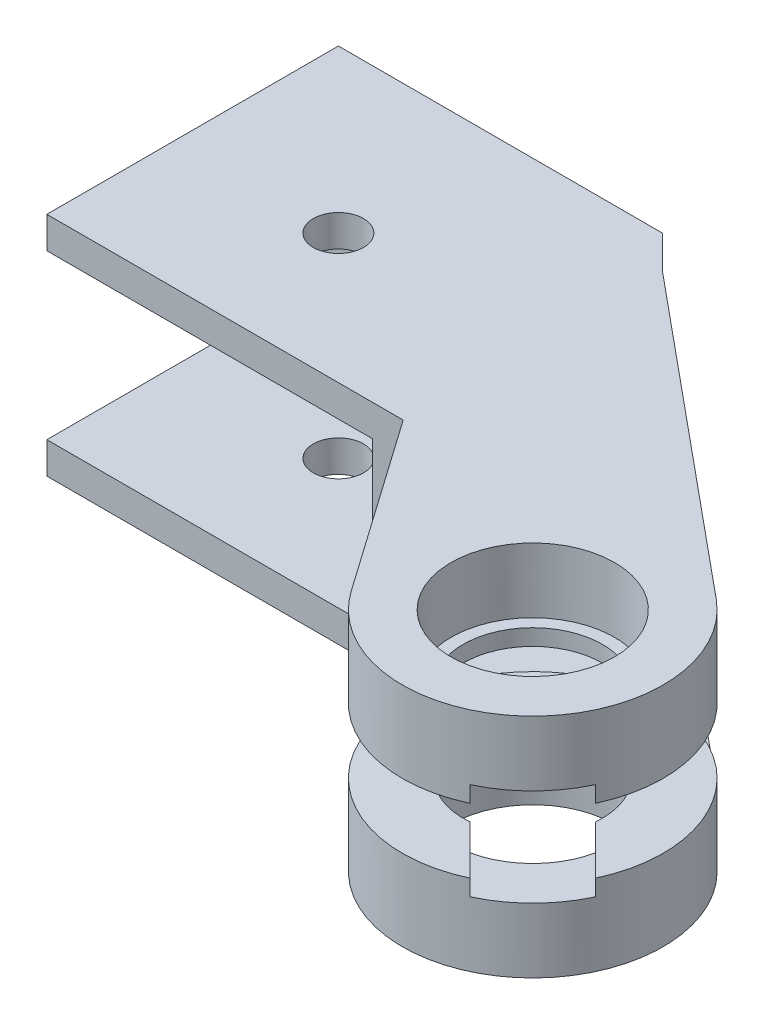
ISO-10303-21;
HEADER;
FILE_DESCRIPTION(('STEP AP214'),'2;1');
FILE_NAME('part.step','',(''),(''),'','','');
FILE_SCHEMA(('AUTOMOTIVE_DESIGN { 1 0 10303 214 1 1 1 1 }'));
ENDSEC;
DATA;
#1=APPLICATION_CONTEXT('core data for automotive mechanical design processes');
#2=APPLICATION_PROTOCOL_DEFINITION('international standard','automotive_design',2000,#1);
#3=PRODUCT_CONTEXT('',#1,'mechanical');
#4=PRODUCT('Part','Part','',(#3));
#5=PRODUCT_RELATED_PRODUCT_CATEGORY('part','',(#4));
#6=PRODUCT_DEFINITION_FORMATION('','',#4);
#7=PRODUCT_DEFINITION_CONTEXT('part definition',#1,'design');
#8=PRODUCT_DEFINITION('design','',#6,#7);
#9=PRODUCT_DEFINITION_SHAPE('','',#8);
#10=(LENGTH_UNIT() NAMED_UNIT(*) SI_UNIT(.MILLI.,.METRE.));
#11=(NAMED_UNIT(*) PLANE_ANGLE_UNIT() SI_UNIT($,.RADIAN.));
#12=(NAMED_UNIT(*) SI_UNIT($,.STERADIAN.) SOLID_ANGLE_UNIT());
#13=UNCERTAINTY_MEASURE_WITH_UNIT(LENGTH_MEASURE(1.E-05),#10,'distance_accuracy_value','');
#14=(GEOMETRIC_REPRESENTATION_CONTEXT(3) GLOBAL_UNCERTAINTY_ASSIGNED_CONTEXT((#13)) GLOBAL_UNIT_ASSIGNED_CONTEXT((#10,
#11,#12)) REPRESENTATION_CONTEXT('',''));
#15=CARTESIAN_POINT('',(0.,0.,0.));
#16=DIRECTION('',(0.,0.,1.));
#17=DIRECTION('',(1.,0.,0.));
#18=AXIS2_PLACEMENT_3D('',#15,#16,#17);
#19=CARTESIAN_POINT('',(14.1421356237309,-3.,14.142135623731));
#20=DIRECTION('',(0.,-1.,0.));
#21=DIRECTION('',(0.,0.,-1.));
#22=AXIS2_PLACEMENT_3D('',#19,#20,#21);
#23=PLANE('',#22);
#24=DIRECTION('',(-0.930502035697124,0.,0.366286720430196));
#25=VECTOR('',#24,1.);
#26=CARTESIAN_POINT('',(0.,-3.,8.));
#27=LINE('',#26,#25);
#28=CARTESIAN_POINT('',(13.1076082229817,-3.,2.84026617407359));
#29=VERTEX_POINT('',#28);
#30=CARTESIAN_POINT('',(0.,-3.,8.));
#31=VERTEX_POINT('',#30);
#32=EDGE_CURVE('E269',#29,#31,#27,.T.);
#33=ORIENTED_EDGE('',*,*,#32,.T.);
#34=DIRECTION('',(-0.574297450094056,0.,-0.81864671184551));
#35=VECTOR('',#34,1.);
#36=CARTESIAN_POINT('',(0.,-3.,8.));
#37=LINE('',#36,#35);
#38=CARTESIAN_POINT('',(7.55202959337457,-3.,18.7652300969881));
#39=VERTEX_POINT('',#38);
#40=EDGE_CURVE('E381',#39,#31,#37,.T.);
#41=ORIENTED_EDGE('',*,*,#40,.F.);
#42=CARTESIAN_POINT('',(14.1421356237309,-3.,14.142135623731));
#43=DIRECTION('',(0.,1.,0.));
#44=DIRECTION('',(0.,0.,-1.));
#45=AXIS2_PLACEMENT_3D('',#42,#43,#44);
#46=CIRCLE('',#45,8.05);
#47=CARTESIAN_POINT('',(19.2724741705051,-3.,7.93873926403554));
#48=VERTEX_POINT('',#47);
#49=EDGE_CURVE('E324',#48,#39,#46,.T.);
#50=ORIENTED_EDGE('',*,*,#49,.F.);
#51=DIRECTION('',(0.770608243440427,0.,0.637309136245244));
#52=VECTOR('',#51,1.);
#53=CARTESIAN_POINT('',(0.,-3.,-8.));
#54=LINE('',#53,#52);
#55=EDGE_CURVE('E375',#29,#48,#54,.T.);
#56=ORIENTED_EDGE('',*,*,#55,.F.);
#57=EDGE_LOOP('',(#33,#41,#50,#56));
#58=FACE_BOUND('',#57,.T.);
#59=ADVANCED_FACE('F40',(#58),#23,.F.);
#60=CARTESIAN_POINT('',(14.1421356237309,3.,14.142135623731));
#61=DIRECTION('',(0.,1.,0.));
#62=DIRECTION('',(0.,0.,-1.));
#63=AXIS2_PLACEMENT_3D('',#60,#61,#62);
#64=PLANE('',#63);
#65=DIRECTION('',(-0.930502035697124,0.,0.366286720430196));
#66=VECTOR('',#65,1.);
#67=CARTESIAN_POINT('',(0.,3.,8.));
#68=LINE('',#67,#66);
#69=CARTESIAN_POINT('',(13.1076082229817,3.,2.84026617407359));
#70=VERTEX_POINT('',#69);
#71=CARTESIAN_POINT('',(0.,3.,8.));
#72=VERTEX_POINT('',#71);
#73=EDGE_CURVE('E266',#70,#72,#68,.T.);
#74=ORIENTED_EDGE('',*,*,#73,.F.);
#75=DIRECTION('',(0.770608243440427,0.,0.637309136245244));
#76=VECTOR('',#75,1.);
#77=CARTESIAN_POINT('',(0.,3.,-8.));
#78=LINE('',#77,#76);
#79=CARTESIAN_POINT('',(19.2724741705051,3.,7.93873926403554));
#80=VERTEX_POINT('',#79);
#81=EDGE_CURVE('E355',#70,#80,#78,.T.);
#82=ORIENTED_EDGE('',*,*,#81,.T.);
#83=CARTESIAN_POINT('',(14.1421356237309,3.,14.142135623731));
#84=DIRECTION('',(0.,1.,0.));
#85=DIRECTION('',(0.,0.,-1.));
#86=AXIS2_PLACEMENT_3D('',#83,#84,#85);
#87=CIRCLE('',#86,8.05);
#88=CARTESIAN_POINT('',(7.55202959337457,3.,18.7652300969881));
#89=VERTEX_POINT('',#88);
#90=EDGE_CURVE('E294',#80,#89,#87,.T.);
#91=ORIENTED_EDGE('',*,*,#90,.T.);
#92=DIRECTION('',(-0.574297450094056,0.,-0.81864671184551));
#93=VECTOR('',#92,1.);
#94=CARTESIAN_POINT('',(0.,3.,8.));
#95=LINE('',#94,#93);
#96=EDGE_CURVE('E349',#89,#72,#95,.T.);
#97=ORIENTED_EDGE('',*,*,#96,.T.);
#98=EDGE_LOOP('',(#74,#82,#91,#97));
#99=FACE_BOUND('',#98,.T.);
#100=ADVANCED_FACE('F460',(#99),#64,.F.);
#101=CARTESIAN_POINT('',(14.1421356237309,3.,14.142135623731));
#102=DIRECTION('',(0.,-1.,0.));
#103=DIRECTION('',(0.,0.,-1.));
#104=AXIS2_PLACEMENT_3D('',#101,#102,#103);
#105=CIRCLE('',#104,8.05);
#106=CARTESIAN_POINT('',(21.436445622032,3.,17.5473583255061));
#107=VERTEX_POINT('',#106);
#108=CARTESIAN_POINT('',(17.547358325506,3.,21.4364456220321));
#109=VERTEX_POINT('',#108);
#110=EDGE_CURVE('E351',#107,#109,#105,.T.);
#111=ORIENTED_EDGE('',*,*,#110,.T.);
#112=DIRECTION('',(-0.707106781186546,0.,-0.707106781186549));
#113=VECTOR('',#112,1.);
#114=CARTESIAN_POINT('',(14.5350585527691,3.,18.4241458492951));
#115=LINE('',#114,#113);
#116=CARTESIAN_POINT('',(15.1925878018423,3.,19.0816750983684));
#117=VERTEX_POINT('',#116);
#118=EDGE_CURVE('E291',#109,#117,#115,.T.);
#119=ORIENTED_EDGE('',*,*,#118,.T.);
#120=CARTESIAN_POINT('',(14.1421356237309,3.,14.142135623731));
#121=DIRECTION('',(0.,-1.,0.));
#122=DIRECTION('',(0.,0.,-1.));
#123=AXIS2_PLACEMENT_3D('',#120,#121,#122);
#124=CIRCLE('',#123,5.05);
#125=CARTESIAN_POINT('',(19.0816750983683,3.,15.1925878018424));
#126=VERTEX_POINT('',#125);
#127=EDGE_CURVE('E342',#126,#117,#124,.T.);
#128=ORIENTED_EDGE('',*,*,#127,.F.);
#129=DIRECTION('',(0.707106781186546,0.,0.707106781186549));
#130=VECTOR('',#129,1.);
#131=CARTESIAN_POINT('',(21.436445622032,3.,17.5473583255061));
#132=LINE('',#131,#130);
#133=EDGE_CURVE('E296',#126,#107,#132,.T.);
#134=ORIENTED_EDGE('',*,*,#133,.T.);
#135=EDGE_LOOP('',(#111,#119,#128,#134));
#136=FACE_BOUND('',#135,.T.);
#137=ADVANCED_FACE('F488',(#136),#64,.F.);
#138=DIRECTION('',(0.707106781186546,0.,0.707106781186549));
#139=VECTOR('',#138,1.);
#140=CARTESIAN_POINT('',(21.436445622032,-3.,17.5473583255061));
#141=LINE('',#140,#139);
#142=CARTESIAN_POINT('',(19.0816750983683,-3.,15.1925878018424));
#143=VERTEX_POINT('',#142);
#144=CARTESIAN_POINT('',(21.436445622032,-3.,17.5473583255061));
#145=VERTEX_POINT('',#144);
#146=EDGE_CURVE('E320',#143,#145,#141,.T.);
#147=ORIENTED_EDGE('',*,*,#146,.F.);
#148=CARTESIAN_POINT('',(14.1421356237309,-3.,14.142135623731));
#149=DIRECTION('',(0.,-1.,0.));
#150=DIRECTION('',(0.,0.,-1.));
#151=AXIS2_PLACEMENT_3D('',#148,#149,#150);
#152=CIRCLE('',#151,5.05);
#153=CARTESIAN_POINT('',(15.1925878018423,-3.,19.0816750983684));
#154=VERTEX_POINT('',#153);
#155=EDGE_CURVE('E368',#143,#154,#152,.T.);
#156=ORIENTED_EDGE('',*,*,#155,.T.);
#157=DIRECTION('',(-0.707106781186546,0.,-0.707106781186549));
#158=VECTOR('',#157,1.);
#159=CARTESIAN_POINT('',(14.5350585527691,-3.,18.4241458492951));
#160=LINE('',#159,#158);
#161=CARTESIAN_POINT('',(17.547358325506,-3.,21.4364456220321));
#162=VERTEX_POINT('',#161);
#163=EDGE_CURVE('E311',#162,#154,#160,.T.);
#164=ORIENTED_EDGE('',*,*,#163,.F.);
#165=CARTESIAN_POINT('',(14.1421356237309,-3.,14.142135623731));
#166=DIRECTION('',(0.,-1.,0.));
#167=DIRECTION('',(0.,0.,-1.));
#168=AXIS2_PLACEMENT_3D('',#165,#166,#167);
#169=CIRCLE('',#168,8.05);
#170=EDGE_CURVE('E377',#145,#162,#169,.T.);
#171=ORIENTED_EDGE('',*,*,#170,.F.);
#172=EDGE_LOOP('',(#147,#156,#164,#171));
#173=FACE_BOUND('',#172,.T.);
#174=ADVANCED_FACE('F484',(#173),#23,.F.);
#175=CARTESIAN_POINT('',(-12.,7.,8.));
#176=DIRECTION('',(0.,0.,-1.));
#177=DIRECTION('',(-1.,0.,0.));
#178=AXIS2_PLACEMENT_3D('',#175,#176,#177);
#179=PLANE('',#178);
#180=DIRECTION('',(1.,0.,0.));
#181=VECTOR('',#180,1.);
#182=CARTESIAN_POINT('',(-12.,7.,8.));
#183=LINE('',#182,#181);
#184=CARTESIAN_POINT('',(-22.,7.,8.));
#185=VERTEX_POINT('',#184);
#186=CARTESIAN_POINT('',(0.,7.,8.));
#187=VERTEX_POINT('',#186);
#188=EDGE_CURVE('E407',#185,#187,#183,.T.);
#189=ORIENTED_EDGE('',*,*,#188,.F.);
#190=DIRECTION('',(0.,1.,0.));
#191=VECTOR('',#190,1.);
#192=CARTESIAN_POINT('',(-22.,7.,8.));
#193=LINE('',#192,#191);
#194=CARTESIAN_POINT('',(-22.,5.05,8.));
#195=VERTEX_POINT('',#194);
#196=EDGE_CURVE('E260',#195,#185,#193,.T.);
#197=ORIENTED_EDGE('',*,*,#196,.F.);
#198=DIRECTION('',(-1.,0.,0.));
#199=VECTOR('',#198,1.);
#200=CARTESIAN_POINT('',(-1.9,5.05,8.));
#201=LINE('',#200,#199);
#202=CARTESIAN_POINT('',(-1.9,5.05,8.));
#203=VERTEX_POINT('',#202);
#204=EDGE_CURVE('E403',#203,#195,#201,.T.);
#205=ORIENTED_EDGE('',*,*,#204,.F.);
#206=DIRECTION('',(0.,1.,0.));
#207=VECTOR('',#206,1.);
#208=CARTESIAN_POINT('',(-1.9,-5.05,8.));
#209=LINE('',#208,#207);
#210=CARTESIAN_POINT('',(-1.9,-5.05,8.));
#211=VERTEX_POINT('',#210);
#212=EDGE_CURVE('E398',#211,#203,#209,.T.);
#213=ORIENTED_EDGE('',*,*,#212,.F.);
#214=DIRECTION('',(-1.,0.,0.));
#215=VECTOR('',#214,1.);
#216=CARTESIAN_POINT('',(-1.9,-5.05,8.));
#217=LINE('',#216,#215);
#218=CARTESIAN_POINT('',(-22.,-5.05,8.));
#219=VERTEX_POINT('',#218);
#220=EDGE_CURVE('E402',#211,#219,#217,.T.);
#221=ORIENTED_EDGE('',*,*,#220,.T.);
#222=DIRECTION('',(0.,1.,0.));
#223=VECTOR('',#222,1.);
#224=CARTESIAN_POINT('',(-22.,-5.05,8.));
#225=LINE('',#224,#223);
#226=CARTESIAN_POINT('',(-22.,-7.,8.));
#227=VERTEX_POINT('',#226);
#228=EDGE_CURVE('E217',#227,#219,#225,.T.);
#229=ORIENTED_EDGE('',*,*,#228,.F.);
#230=DIRECTION('',(1.,0.,0.));
#231=VECTOR('',#230,1.);
#232=CARTESIAN_POINT('',(-12.,-7.,8.));
#233=LINE('',#232,#231);
#234=CARTESIAN_POINT('',(0.,-7.,8.));
#235=VERTEX_POINT('',#234);
#236=EDGE_CURVE('E405',#227,#235,#233,.T.);
#237=ORIENTED_EDGE('',*,*,#236,.T.);
#238=DIRECTION('',(0.,-1.,0.));
#239=VECTOR('',#238,1.);
#240=CARTESIAN_POINT('',(0.,-3.,8.));
#241=LINE('',#240,#239);
#242=EDGE_CURVE('E392',#31,#235,#241,.T.);
#243=ORIENTED_EDGE('',*,*,#242,.F.);
#244=DIRECTION('',(0.,-1.,0.));
#245=VECTOR('',#244,1.);
#246=CARTESIAN_POINT('',(0.,7.,8.));
#247=LINE('',#246,#245);
#248=EDGE_CURVE('E414',#72,#31,#247,.T.);
#249=ORIENTED_EDGE('',*,*,#248,.F.);
#250=EDGE_CURVE('E415',#187,#72,#247,.T.);
#251=ORIENTED_EDGE('',*,*,#250,.F.);
#252=EDGE_LOOP('',(#189,#197,#205,#213,#221,#229,#237,#243,#249,#251));
#253=FACE_BOUND('',#252,.T.);
#254=ADVANCED_FACE('F442',(#253),#179,.F.);
#255=CARTESIAN_POINT('',(0.,7.,0.));
#256=DIRECTION('',(0.,1.,0.));
#257=DIRECTION('',(0.,0.,1.));
#258=AXIS2_PLACEMENT_3D('',#255,#256,#257);
#259=PLANE('',#258);
#260=CARTESIAN_POINT('',(-11.9999999999999,7.,0.));
#261=DIRECTION('',(0.,1.,0.));
#262=DIRECTION('',(0.,0.,1.));
#263=AXIS2_PLACEMENT_3D('',#260,#261,#262);
#264=CIRCLE('',#263,1.55000000000001);
#265=CARTESIAN_POINT('',(-11.9999999999999,7.,1.54999999999999));
#266=VERTEX_POINT('',#265);
#267=EDGE_CURVE('E239',#266,#266,#264,.T.);
#268=ORIENTED_EDGE('',*,*,#267,.F.);
#269=EDGE_LOOP('',(#268));
#270=FACE_BOUND('',#269,.T.);
#271=DIRECTION('',(0.770608243440427,0.,0.637309136245244));
#272=VECTOR('',#271,1.);
#273=CARTESIAN_POINT('',(0.,7.,-8.));
#274=LINE('',#273,#272);
#275=CARTESIAN_POINT('',(0.,7.,-8.));
#276=VERTEX_POINT('',#275);
#277=CARTESIAN_POINT('',(19.2724741705051,7.,7.93873926403554));
#278=VERTEX_POINT('',#277);
#279=EDGE_CURVE('E352',#276,#278,#274,.T.);
#280=ORIENTED_EDGE('',*,*,#279,.F.);
#281=DIRECTION('',(-0.707106781186546,0.,-0.707106781186549));
#282=VECTOR('',#281,1.);
#283=CARTESIAN_POINT('',(4.,7.,-3.99999999999998));
#284=LINE('',#283,#282);
#285=CARTESIAN_POINT('',(-2.,7.,-10.));
#286=VERTEX_POINT('',#285);
#287=EDGE_CURVE('E11',#276,#286,#284,.T.);
#288=ORIENTED_EDGE('',*,*,#287,.T.);
#289=DIRECTION('',(1.,0.,0.));
#290=VECTOR('',#289,1.);
#291=CARTESIAN_POINT('',(0.,7.,-10.));
#292=LINE('',#291,#290);
#293=CARTESIAN_POINT('',(-22.,7.,-10.));
#294=VERTEX_POINT('',#293);
#295=EDGE_CURVE('E219',#294,#286,#292,.T.);
#296=ORIENTED_EDGE('',*,*,#295,.F.);
#297=DIRECTION('',(0.,0.,-1.));
#298=VECTOR('',#297,1.);
#299=CARTESIAN_POINT('',(-22.,7.,-8.));
#300=LINE('',#299,#298);
#301=EDGE_CURVE('E263',#185,#294,#300,.T.);
#302=ORIENTED_EDGE('',*,*,#301,.F.);
#303=ORIENTED_EDGE('',*,*,#188,.T.);
#304=DIRECTION('',(-0.574297450094056,0.,-0.81864671184551));
#305=VECTOR('',#304,1.);
#306=CARTESIAN_POINT('',(0.,7.,8.));
#307=LINE('',#306,#305);
#308=CARTESIAN_POINT('',(7.55202959337457,7.,18.7652300969881));
#309=VERTEX_POINT('',#308);
#310=EDGE_CURVE('E345',#309,#187,#307,.T.);
#311=ORIENTED_EDGE('',*,*,#310,.F.);
#312=CARTESIAN_POINT('',(14.1421356237309,7.,14.142135623731));
#313=DIRECTION('',(0.,-1.,0.));
#314=DIRECTION('',(0.,0.,-1.));
#315=AXIS2_PLACEMENT_3D('',#312,#313,#314);
#316=CIRCLE('',#315,8.05);
#317=EDGE_CURVE('E359',#278,#309,#316,.T.);
#318=ORIENTED_EDGE('',*,*,#317,.F.);
#319=EDGE_LOOP('',(#280,#288,#296,#302,#303,#311,#318));
#320=FACE_BOUND('',#319,.T.);
#321=CARTESIAN_POINT('',(14.1421356237309,7.,14.142135623731));
#322=DIRECTION('',(0.,-1.,0.));
#323=DIRECTION('',(0.,0.,-1.));
#324=AXIS2_PLACEMENT_3D('',#321,#322,#323);
#325=CIRCLE('',#324,5.05);
#326=CARTESIAN_POINT('',(14.1421356237309,7.,9.09213562373098));
#327=VERTEX_POINT('',#326);
#328=EDGE_CURVE('E341',#327,#327,#325,.T.);
#329=ORIENTED_EDGE('',*,*,#328,.T.);
#330=EDGE_LOOP('',(#329));
#331=FACE_BOUND('',#330,.T.);
#332=ADVANCED_FACE('F435',(#270,#320,#331),#259,.T.);
#333=CARTESIAN_POINT('',(0.,-7.,0.));
#334=DIRECTION('',(0.,1.,0.));
#335=DIRECTION('',(0.,0.,1.));
#336=AXIS2_PLACEMENT_3D('',#333,#334,#335);
#337=PLANE('',#336);
#338=CARTESIAN_POINT('',(-11.9999999999999,-7.,0.));
#339=DIRECTION('',(0.,1.,0.));
#340=DIRECTION('',(0.,0.,1.));
#341=AXIS2_PLACEMENT_3D('',#338,#339,#340);
#342=CIRCLE('',#341,1.55000000000001);
#343=CARTESIAN_POINT('',(-11.9999999999999,-7.,1.54999999999999));
#344=VERTEX_POINT('',#343);
#345=EDGE_CURVE('E242',#344,#344,#342,.F.);
#346=ORIENTED_EDGE('',*,*,#345,.F.);
#347=EDGE_LOOP('',(#346));
#348=FACE_BOUND('',#347,.T.);
#349=DIRECTION('',(-1.,0.,0.));
#350=VECTOR('',#349,1.);
#351=CARTESIAN_POINT('',(0.,-7.,-10.));
#352=LINE('',#351,#350);
#353=CARTESIAN_POINT('',(-2.,-7.,-10.));
#354=VERTEX_POINT('',#353);
#355=CARTESIAN_POINT('',(-22.,-7.,-10.));
#356=VERTEX_POINT('',#355);
#357=EDGE_CURVE('E249',#354,#356,#352,.T.);
#358=ORIENTED_EDGE('',*,*,#357,.F.);
#359=DIRECTION('',(0.707106781186546,0.,0.707106781186549));
#360=VECTOR('',#359,1.);
#361=CARTESIAN_POINT('',(-2.,-7.,-10.));
#362=LINE('',#361,#360);
#363=CARTESIAN_POINT('',(0.,-7.,-8.));
#364=VERTEX_POINT('',#363);
#365=EDGE_CURVE('E49',#354,#364,#362,.T.);
#366=ORIENTED_EDGE('',*,*,#365,.T.);
#367=DIRECTION('',(0.770608243440427,0.,0.637309136245244));
#368=VECTOR('',#367,1.);
#369=CARTESIAN_POINT('',(0.,-7.,-8.));
#370=LINE('',#369,#368);
#371=CARTESIAN_POINT('',(19.2724741705051,-7.,7.93873926403554));
#372=VERTEX_POINT('',#371);
#373=EDGE_CURVE('E371',#364,#372,#370,.T.);
#374=ORIENTED_EDGE('',*,*,#373,.T.);
#375=CARTESIAN_POINT('',(14.1421356237309,-7.,14.142135623731));
#376=DIRECTION('',(0.,-1.,0.));
#377=DIRECTION('',(0.,0.,-1.));
#378=AXIS2_PLACEMENT_3D('',#375,#376,#377);
#379=CIRCLE('',#378,8.05);
#380=CARTESIAN_POINT('',(7.55202959337457,-7.,18.7652300969881));
#381=VERTEX_POINT('',#380);
#382=EDGE_CURVE('E387',#372,#381,#379,.T.);
#383=ORIENTED_EDGE('',*,*,#382,.T.);
#384=DIRECTION('',(-0.574297450094056,0.,-0.81864671184551));
#385=VECTOR('',#384,1.);
#386=CARTESIAN_POINT('',(0.,-7.,8.));
#387=LINE('',#386,#385);
#388=EDGE_CURVE('E378',#381,#235,#387,.T.);
#389=ORIENTED_EDGE('',*,*,#388,.T.);
#390=ORIENTED_EDGE('',*,*,#236,.F.);
#391=DIRECTION('',(0.,0.,1.));
#392=VECTOR('',#391,1.);
#393=CARTESIAN_POINT('',(-22.,-7.,-8.));
#394=LINE('',#393,#392);
#395=EDGE_CURVE('E256',#356,#227,#394,.T.);
#396=ORIENTED_EDGE('',*,*,#395,.F.);
#397=EDGE_LOOP('',(#358,#366,#374,#383,#389,#390,#396));
#398=FACE_BOUND('',#397,.T.);
#399=CARTESIAN_POINT('',(14.1421356237309,-7.,14.142135623731));
#400=DIRECTION('',(0.,-1.,0.));
#401=DIRECTION('',(0.,0.,-1.));
#402=AXIS2_PLACEMENT_3D('',#399,#400,#401);
#403=CIRCLE('',#402,5.05);
#404=CARTESIAN_POINT('',(14.1421356237309,-7.,9.09213562373098));
#405=VERTEX_POINT('',#404);
#406=EDGE_CURVE('E365',#405,#405,#403,.T.);
#407=ORIENTED_EDGE('',*,*,#406,.F.);
#408=EDGE_LOOP('',(#407));
#409=FACE_BOUND('',#408,.T.);
#410=ADVANCED_FACE('F424',(#348,#398,#409),#337,.F.);
#411=CARTESIAN_POINT('',(-1.9,5.05,-8.));
#412=DIRECTION('',(0.,1.,0.));
#413=DIRECTION('',(0.,0.,1.));
#414=AXIS2_PLACEMENT_3D('',#411,#412,#413);
#415=PLANE('',#414);
#416=CARTESIAN_POINT('',(-11.9999999999999,5.05,0.));
#417=DIRECTION('',(0.,1.,0.));
#418=DIRECTION('',(0.,0.,1.));
#419=AXIS2_PLACEMENT_3D('',#416,#417,#418);
#420=CIRCLE('',#419,1.55000000000001);
#421=CARTESIAN_POINT('',(-11.9999999999999,5.05,1.54999999999999));
#422=VERTEX_POINT('',#421);
#423=EDGE_CURVE('E246',#422,#422,#420,.T.);
#424=ORIENTED_EDGE('',*,*,#423,.T.);
#425=EDGE_LOOP('',(#424));
#426=FACE_BOUND('',#425,.T.);
#427=ORIENTED_EDGE('',*,*,#204,.T.);
#428=DIRECTION('',(0.,0.,1.));
#429=VECTOR('',#428,1.);
#430=CARTESIAN_POINT('',(-22.,5.05,-8.));
#431=LINE('',#430,#429);
#432=CARTESIAN_POINT('',(-22.,5.05,-8.1));
#433=VERTEX_POINT('',#432);
#434=EDGE_CURVE('E258',#433,#195,#431,.T.);
#435=ORIENTED_EDGE('',*,*,#434,.F.);
#436=DIRECTION('',(-1.,0.,0.));
#437=VECTOR('',#436,1.);
#438=CARTESIAN_POINT('',(-22.,5.05,-8.1));
#439=LINE('',#438,#437);
#440=CARTESIAN_POINT('',(-1.9,5.05,-8.1));
#441=VERTEX_POINT('',#440);
#442=EDGE_CURVE('E234',#441,#433,#439,.T.);
#443=ORIENTED_EDGE('',*,*,#442,.F.);
#444=DIRECTION('',(0.,0.,-1.));
#445=VECTOR('',#444,1.);
#446=CARTESIAN_POINT('',(-1.9,5.05,-8.));
#447=LINE('',#446,#445);
#448=EDGE_CURVE('E400',#203,#441,#447,.T.);
#449=ORIENTED_EDGE('',*,*,#448,.F.);
#450=EDGE_LOOP('',(#427,#435,#443,#449));
#451=FACE_BOUND('',#450,.T.);
#452=ADVANCED_FACE('F555',(#426,#451),#415,.F.);
#453=CARTESIAN_POINT('',(-1.9,-5.05,-8.));
#454=DIRECTION('',(0.,-1.,0.));
#455=DIRECTION('',(0.,0.,-1.));
#456=AXIS2_PLACEMENT_3D('',#453,#454,#455);
#457=PLANE('',#456);
#458=CARTESIAN_POINT('',(-11.9999999999999,-5.05,0.));
#459=DIRECTION('',(0.,-1.,0.));
#460=DIRECTION('',(0.,0.,-1.));
#461=AXIS2_PLACEMENT_3D('',#458,#459,#460);
#462=CIRCLE('',#461,1.55000000000001);
#463=CARTESIAN_POINT('',(-11.9999999999999,-5.05,-1.55000000000003));
#464=VERTEX_POINT('',#463);
#465=EDGE_CURVE('E245',#464,#464,#462,.T.);
#466=ORIENTED_EDGE('',*,*,#465,.T.);
#467=EDGE_LOOP('',(#466));
#468=FACE_BOUND('',#467,.T.);
#469=DIRECTION('',(0.,0.,1.));
#470=VECTOR('',#469,1.);
#471=CARTESIAN_POINT('',(-1.9,-5.05,-8.));
#472=LINE('',#471,#470);
#473=CARTESIAN_POINT('',(-1.9,-5.05,-8.1));
#474=VERTEX_POINT('',#473);
#475=EDGE_CURVE('E225',#474,#211,#472,.T.);
#476=ORIENTED_EDGE('',*,*,#475,.F.);
#477=DIRECTION('',(1.,0.,0.));
#478=VECTOR('',#477,1.);
#479=CARTESIAN_POINT('',(-22.,-5.05,-8.1));
#480=LINE('',#479,#478);
#481=CARTESIAN_POINT('',(-22.,-5.05,-8.1));
#482=VERTEX_POINT('',#481);
#483=EDGE_CURVE('E222',#482,#474,#480,.T.);
#484=ORIENTED_EDGE('',*,*,#483,.F.);
#485=DIRECTION('',(0.,0.,-1.));
#486=VECTOR('',#485,1.);
#487=CARTESIAN_POINT('',(-22.,-5.05,-8.));
#488=LINE('',#487,#486);
#489=EDGE_CURVE('E209',#219,#482,#488,.T.);
#490=ORIENTED_EDGE('',*,*,#489,.F.);
#491=ORIENTED_EDGE('',*,*,#220,.F.);
#492=EDGE_LOOP('',(#476,#484,#490,#491));
#493=FACE_BOUND('',#492,.T.);
#494=ADVANCED_FACE('F223',(#468,#493),#457,.F.);
#495=CARTESIAN_POINT('',(-1.9,0.,0.));
#496=DIRECTION('',(1.,0.,0.));
#497=DIRECTION('',(0.,0.,-1.));
#498=AXIS2_PLACEMENT_3D('',#495,#496,#497);
#499=PLANE('',#498);
#500=ORIENTED_EDGE('',*,*,#448,.T.);
#501=DIRECTION('',(0.,1.,0.));
#502=VECTOR('',#501,1.);
#503=CARTESIAN_POINT('',(-1.9,5.05,-8.1));
#504=LINE('',#503,#502);
#505=EDGE_CURVE('E229',#474,#441,#504,.T.);
#506=ORIENTED_EDGE('',*,*,#505,.F.);
#507=ORIENTED_EDGE('',*,*,#475,.T.);
#508=ORIENTED_EDGE('',*,*,#212,.T.);
#509=EDGE_LOOP('',(#500,#506,#507,#508));
#510=FACE_BOUND('',#509,.T.);
#511=ADVANCED_FACE('F480',(#510),#499,.F.);
#512=CARTESIAN_POINT('',(0.,-3.,8.));
#513=DIRECTION('',(-0.81864671184551,0.,0.574297450094056));
#514=DIRECTION('',(0.574297450094056,0.,0.81864671184551));
#515=AXIS2_PLACEMENT_3D('',#512,#513,#514);
#516=PLANE('',#515);
#517=ORIENTED_EDGE('',*,*,#388,.F.);
#518=DIRECTION('',(0.,-1.,0.));
#519=VECTOR('',#518,1.);
#520=CARTESIAN_POINT('',(7.55202959337457,-3.,18.7652300969881));
#521=LINE('',#520,#519);
#522=EDGE_CURVE('E394',#39,#381,#521,.T.);
#523=ORIENTED_EDGE('',*,*,#522,.F.);
#524=ORIENTED_EDGE('',*,*,#40,.T.);
#525=ORIENTED_EDGE('',*,*,#242,.T.);
#526=EDGE_LOOP('',(#517,#523,#524,#525));
#527=FACE_BOUND('',#526,.T.);
#528=ADVANCED_FACE('F468',(#527),#516,.T.);
#529=CARTESIAN_POINT('',(14.1421356237309,-3.,14.142135623731));
#530=DIRECTION('',(0.,-1.,0.));
#531=DIRECTION('',(0.,0.,-1.));
#532=AXIS2_PLACEMENT_3D('',#529,#530,#531);
#533=CYLINDRICAL_SURFACE('',#532,8.05);
#534=DIRECTION('',(0.,-1.,0.));
#535=VECTOR('',#534,1.);
#536=CARTESIAN_POINT('',(21.436445622032,-2.,17.5473583255061));
#537=LINE('',#536,#535);
#538=CARTESIAN_POINT('',(21.436445622032,-2.,17.5473583255061));
#539=VERTEX_POINT('',#538);
#540=EDGE_CURVE('E335',#539,#145,#537,.T.);
#541=ORIENTED_EDGE('',*,*,#540,.T.);
#542=ORIENTED_EDGE('',*,*,#170,.T.);
#543=DIRECTION('',(0.,-1.,0.));
#544=VECTOR('',#543,1.);
#545=CARTESIAN_POINT('',(17.547358325506,-2.,21.4364456220321));
#546=LINE('',#545,#544);
#547=CARTESIAN_POINT('',(17.547358325506,-2.,21.4364456220321));
#548=VERTEX_POINT('',#547);
#549=EDGE_CURVE('E332',#548,#162,#546,.T.);
#550=ORIENTED_EDGE('',*,*,#549,.F.);
#551=CARTESIAN_POINT('',(14.1421356237309,-2.,14.142135623731));
#552=DIRECTION('',(0.,1.,0.));
#553=DIRECTION('',(0.,0.,-1.));
#554=AXIS2_PLACEMENT_3D('',#551,#552,#553);
#555=CIRCLE('',#554,8.05);
#556=EDGE_CURVE('E313',#539,#548,#555,.T.);
#557=ORIENTED_EDGE('',*,*,#556,.F.);
#558=EDGE_LOOP('',(#541,#542,#550,#557));
#559=FACE_BOUND('',#558,.T.);
#560=ORIENTED_EDGE('',*,*,#382,.F.);
#561=DIRECTION('',(0.,-1.,0.));
#562=VECTOR('',#561,1.);
#563=CARTESIAN_POINT('',(19.2724741705051,-3.,7.93873926403554));
#564=LINE('',#563,#562);
#565=EDGE_CURVE('E384',#48,#372,#564,.T.);
#566=ORIENTED_EDGE('',*,*,#565,.F.);
#567=ORIENTED_EDGE('',*,*,#49,.T.);
#568=ORIENTED_EDGE('',*,*,#522,.T.);
#569=EDGE_LOOP('',(#560,#566,#567,#568));
#570=FACE_BOUND('',#569,.T.);
#571=ADVANCED_FACE('F470',(#559,#570),#533,.T.);
#572=CARTESIAN_POINT('',(0.,-3.,-8.));
#573=DIRECTION('',(0.637309136245244,0.,-0.770608243440427));
#574=DIRECTION('',(-0.770608243440427,0.,-0.637309136245244));
#575=AXIS2_PLACEMENT_3D('',#572,#573,#574);
#576=PLANE('',#575);
#577=ORIENTED_EDGE('',*,*,#373,.F.);
#578=DIRECTION('',(0.,-1.,0.));
#579=VECTOR('',#578,1.);
#580=CARTESIAN_POINT('',(0.,7.,-8.));
#581=LINE('',#580,#579);
#582=EDGE_CURVE('E410',#276,#364,#581,.T.);
#583=ORIENTED_EDGE('',*,*,#582,.F.);
#584=ORIENTED_EDGE('',*,*,#279,.T.);
#585=DIRECTION('',(0.,1.,0.));
#586=VECTOR('',#585,1.);
#587=CARTESIAN_POINT('',(19.2724741705051,3.,7.93873926403554));
#588=LINE('',#587,#586);
#589=EDGE_CURVE('E362',#80,#278,#588,.T.);
#590=ORIENTED_EDGE('',*,*,#589,.F.);
#591=ORIENTED_EDGE('',*,*,#81,.F.);
#592=DIRECTION('',(0.,1.,0.));
#593=VECTOR('',#592,1.);
#594=CARTESIAN_POINT('',(13.1076082229817,-23.6835536919355,2.84026617407359));
#595=LINE('',#594,#593);
#596=EDGE_CURVE('E265',#29,#70,#595,.T.);
#597=ORIENTED_EDGE('',*,*,#596,.F.);
#598=ORIENTED_EDGE('',*,*,#55,.T.);
#599=ORIENTED_EDGE('',*,*,#565,.T.);
#600=EDGE_LOOP('',(#577,#583,#584,#590,#591,#597,#598,#599));
#601=FACE_BOUND('',#600,.T.);
#602=ADVANCED_FACE('F428',(#601),#576,.T.);
#603=CARTESIAN_POINT('',(14.1421356237309,-3.,14.142135623731));
#604=DIRECTION('',(0.,-1.,0.));
#605=DIRECTION('',(0.,0.,-1.));
#606=AXIS2_PLACEMENT_3D('',#603,#604,#605);
#607=CYLINDRICAL_SURFACE('',#606,5.05);
#608=ORIENTED_EDGE('',*,*,#155,.F.);
#609=EDGE_CURVE('E372',#154,#143,#152,.T.);
#610=ORIENTED_EDGE('',*,*,#609,.F.);
#611=EDGE_LOOP('',(#608,#610));
#612=FACE_BOUND('',#611,.T.);
#613=ORIENTED_EDGE('',*,*,#406,.T.);
#614=EDGE_LOOP('',(#613));
#615=FACE_BOUND('',#614,.T.);
#616=ADVANCED_FACE('F478',(#612,#615),#607,.F.);
#617=CARTESIAN_POINT('',(14.1421356237309,3.,14.142135623731));
#618=DIRECTION('',(0.,1.,0.));
#619=DIRECTION('',(0.,0.,1.));
#620=AXIS2_PLACEMENT_3D('',#617,#618,#619);
#621=CYLINDRICAL_SURFACE('',#620,8.05);
#622=ORIENTED_EDGE('',*,*,#110,.F.);
#623=DIRECTION('',(0.,1.,0.));
#624=VECTOR('',#623,1.);
#625=CARTESIAN_POINT('',(21.436445622032,2.,17.5473583255061));
#626=LINE('',#625,#624);
#627=CARTESIAN_POINT('',(21.436445622032,2.,17.5473583255061));
#628=VERTEX_POINT('',#627);
#629=EDGE_CURVE('E299',#628,#107,#626,.T.);
#630=ORIENTED_EDGE('',*,*,#629,.F.);
#631=CARTESIAN_POINT('',(14.1421356237309,2.,14.142135623731));
#632=DIRECTION('',(0.,1.,0.));
#633=DIRECTION('',(0.,0.,-1.));
#634=AXIS2_PLACEMENT_3D('',#631,#632,#633);
#635=CIRCLE('',#634,8.05);
#636=CARTESIAN_POINT('',(17.547358325506,2.,21.4364456220321));
#637=VERTEX_POINT('',#636);
#638=EDGE_CURVE('E281',#628,#637,#635,.T.);
#639=ORIENTED_EDGE('',*,*,#638,.T.);
#640=DIRECTION('',(0.,1.,0.));
#641=VECTOR('',#640,1.);
#642=CARTESIAN_POINT('',(17.547358325506,2.,21.4364456220321));
#643=LINE('',#642,#641);
#644=EDGE_CURVE('E301',#637,#109,#643,.T.);
#645=ORIENTED_EDGE('',*,*,#644,.T.);
#646=EDGE_LOOP('',(#622,#630,#639,#645));
#647=FACE_BOUND('',#646,.T.);
#648=ORIENTED_EDGE('',*,*,#317,.T.);
#649=DIRECTION('',(0.,1.,0.));
#650=VECTOR('',#649,1.);
#651=CARTESIAN_POINT('',(7.55202959337457,3.,18.7652300969881));
#652=LINE('',#651,#650);
#653=EDGE_CURVE('E357',#89,#309,#652,.T.);
#654=ORIENTED_EDGE('',*,*,#653,.F.);
#655=ORIENTED_EDGE('',*,*,#90,.F.);
#656=ORIENTED_EDGE('',*,*,#589,.T.);
#657=EDGE_LOOP('',(#648,#654,#655,#656));
#658=FACE_BOUND('',#657,.T.);
#659=ADVANCED_FACE('F453',(#647,#658),#621,.T.);
#660=CARTESIAN_POINT('',(0.,3.,8.));
#661=DIRECTION('',(0.81864671184551,0.,-0.574297450094056));
#662=DIRECTION('',(-0.574297450094056,0.,-0.81864671184551));
#663=AXIS2_PLACEMENT_3D('',#660,#661,#662);
#664=PLANE('',#663);
#665=ORIENTED_EDGE('',*,*,#310,.T.);
#666=ORIENTED_EDGE('',*,*,#250,.T.);
#667=ORIENTED_EDGE('',*,*,#96,.F.);
#668=ORIENTED_EDGE('',*,*,#653,.T.);
#669=EDGE_LOOP('',(#665,#666,#667,#668));
#670=FACE_BOUND('',#669,.T.);
#671=ADVANCED_FACE('F449',(#670),#664,.F.);
#672=CARTESIAN_POINT('',(14.1421356237309,3.,14.142135623731));
#673=DIRECTION('',(0.,1.,0.));
#674=DIRECTION('',(0.,0.,1.));
#675=AXIS2_PLACEMENT_3D('',#672,#673,#674);
#676=CYLINDRICAL_SURFACE('',#675,5.05);
#677=ORIENTED_EDGE('',*,*,#127,.T.);
#678=EDGE_CURVE('E346',#117,#126,#124,.T.);
#679=ORIENTED_EDGE('',*,*,#678,.T.);
#680=EDGE_LOOP('',(#677,#679));
#681=FACE_BOUND('',#680,.T.);
#682=ORIENTED_EDGE('',*,*,#328,.F.);
#683=EDGE_LOOP('',(#682));
#684=FACE_BOUND('',#683,.T.);
#685=ADVANCED_FACE('F536',(#681,#684),#676,.F.);
#686=CARTESIAN_POINT('',(14.1421356237309,-3.,14.142135623731));
#687=DIRECTION('',(0.,-1.,0.));
#688=DIRECTION('',(0.,0.,-1.));
#689=AXIS2_PLACEMENT_3D('',#686,#687,#688);
#690=PLANE('',#689);
#691=ORIENTED_EDGE('',*,*,#609,.T.);
#692=CARTESIAN_POINT('',(18.4241458492951,-3.,14.5350585527691));
#693=VERTEX_POINT('',#692);
#694=EDGE_CURVE('E321',#693,#143,#141,.T.);
#695=ORIENTED_EDGE('',*,*,#694,.F.);
#696=CARTESIAN_POINT('',(14.1421356237309,-3.,14.142135623731));
#697=DIRECTION('',(0.,-1.,0.));
#698=DIRECTION('',(0.,0.,-1.));
#699=AXIS2_PLACEMENT_3D('',#696,#697,#698);
#700=CIRCLE('',#699,4.3);
#701=CARTESIAN_POINT('',(14.5350585527691,-3.,18.4241458492951));
#702=VERTEX_POINT('',#701);
#703=EDGE_CURVE('E306',#702,#693,#700,.T.);
#704=ORIENTED_EDGE('',*,*,#703,.F.);
#705=EDGE_CURVE('E327',#154,#702,#160,.T.);
#706=ORIENTED_EDGE('',*,*,#705,.F.);
#707=EDGE_LOOP('',(#691,#695,#704,#706));
#708=FACE_BOUND('',#707,.T.);
#709=ADVANCED_FACE('F505',(#708),#690,.T.);
#710=CARTESIAN_POINT('',(14.1421356237309,-2.,14.142135623731));
#711=DIRECTION('',(0.,-1.,0.));
#712=DIRECTION('',(0.,0.,-1.));
#713=AXIS2_PLACEMENT_3D('',#710,#711,#712);
#714=CYLINDRICAL_SURFACE('',#713,4.3);
#715=ORIENTED_EDGE('',*,*,#703,.T.);
#716=DIRECTION('',(0.,-1.,0.));
#717=VECTOR('',#716,1.);
#718=CARTESIAN_POINT('',(18.4241458492951,-2.,14.5350585527691));
#719=LINE('',#718,#717);
#720=CARTESIAN_POINT('',(18.4241458492951,-2.,14.5350585527691));
#721=VERTEX_POINT('',#720);
#722=EDGE_CURVE('E338',#721,#693,#719,.T.);
#723=ORIENTED_EDGE('',*,*,#722,.F.);
#724=CARTESIAN_POINT('',(14.1421356237309,-2.,14.142135623731));
#725=DIRECTION('',(0.,-1.,0.));
#726=DIRECTION('',(0.,0.,-1.));
#727=AXIS2_PLACEMENT_3D('',#724,#725,#726);
#728=CIRCLE('',#727,4.3);
#729=CARTESIAN_POINT('',(14.5350585527691,-2.,18.4241458492951));
#730=VERTEX_POINT('',#729);
#731=EDGE_CURVE('E307',#730,#721,#728,.T.);
#732=ORIENTED_EDGE('',*,*,#731,.F.);
#733=DIRECTION('',(0.,-1.,0.));
#734=VECTOR('',#733,1.);
#735=CARTESIAN_POINT('',(14.5350585527691,-2.,18.4241458492951));
#736=LINE('',#735,#734);
#737=EDGE_CURVE('E317',#730,#702,#736,.T.);
#738=ORIENTED_EDGE('',*,*,#737,.T.);
#739=EDGE_LOOP('',(#715,#723,#732,#738));
#740=FACE_BOUND('',#739,.T.);
#741=ADVANCED_FACE('F512',(#740),#714,.F.);
#742=CARTESIAN_POINT('',(21.436445622032,-2.,17.5473583255061));
#743=DIRECTION('',(0.707106781186549,0.,-0.707106781186546));
#744=DIRECTION('',(-0.707106781186546,0.,-0.707106781186549));
#745=AXIS2_PLACEMENT_3D('',#742,#743,#744);
#746=PLANE('',#745);
#747=ORIENTED_EDGE('',*,*,#694,.T.);
#748=ORIENTED_EDGE('',*,*,#146,.T.);
#749=ORIENTED_EDGE('',*,*,#540,.F.);
#750=DIRECTION('',(0.707106781186546,0.,0.707106781186549));
#751=VECTOR('',#750,1.);
#752=CARTESIAN_POINT('',(21.436445622032,-2.,17.5473583255061));
#753=LINE('',#752,#751);
#754=EDGE_CURVE('E310',#721,#539,#753,.T.);
#755=ORIENTED_EDGE('',*,*,#754,.F.);
#756=ORIENTED_EDGE('',*,*,#722,.T.);
#757=EDGE_LOOP('',(#747,#748,#749,#755,#756));
#758=FACE_BOUND('',#757,.T.);
#759=ADVANCED_FACE('F508',(#758),#746,.F.);
#760=CARTESIAN_POINT('',(14.5350585527691,-2.,18.4241458492951));
#761=DIRECTION('',(-0.707106781186549,0.,0.707106781186546));
#762=DIRECTION('',(0.707106781186546,0.,0.707106781186549));
#763=AXIS2_PLACEMENT_3D('',#760,#761,#762);
#764=PLANE('',#763);
#765=ORIENTED_EDGE('',*,*,#163,.T.);
#766=ORIENTED_EDGE('',*,*,#705,.T.);
#767=ORIENTED_EDGE('',*,*,#737,.F.);
#768=DIRECTION('',(-0.707106781186546,0.,-0.707106781186549));
#769=VECTOR('',#768,1.);
#770=CARTESIAN_POINT('',(14.5350585527691,-2.,18.4241458492951));
#771=LINE('',#770,#769);
#772=EDGE_CURVE('E315',#548,#730,#771,.T.);
#773=ORIENTED_EDGE('',*,*,#772,.F.);
#774=ORIENTED_EDGE('',*,*,#549,.T.);
#775=EDGE_LOOP('',(#765,#766,#767,#773,#774));
#776=FACE_BOUND('',#775,.T.);
#777=ADVANCED_FACE('F516',(#776),#764,.F.);
#778=CARTESIAN_POINT('',(14.1421356237309,-2.,14.142135623731));
#779=DIRECTION('',(0.,-1.,0.));
#780=DIRECTION('',(0.,0.,-1.));
#781=AXIS2_PLACEMENT_3D('',#778,#779,#780);
#782=PLANE('',#781);
#783=ORIENTED_EDGE('',*,*,#731,.T.);
#784=ORIENTED_EDGE('',*,*,#754,.T.);
#785=ORIENTED_EDGE('',*,*,#556,.T.);
#786=ORIENTED_EDGE('',*,*,#772,.T.);
#787=EDGE_LOOP('',(#783,#784,#785,#786));
#788=FACE_BOUND('',#787,.T.);
#789=ADVANCED_FACE('F520',(#788),#782,.F.);
#790=CARTESIAN_POINT('',(14.1421356237309,3.,14.142135623731));
#791=DIRECTION('',(0.,1.,0.));
#792=DIRECTION('',(0.,0.,-1.));
#793=AXIS2_PLACEMENT_3D('',#790,#791,#792);
#794=PLANE('',#793);
#795=CARTESIAN_POINT('',(18.4241458492951,3.,14.5350585527691));
#796=VERTEX_POINT('',#795);
#797=EDGE_CURVE('E278',#796,#126,#132,.T.);
#798=ORIENTED_EDGE('',*,*,#797,.T.);
#799=ORIENTED_EDGE('',*,*,#678,.F.);
#800=CARTESIAN_POINT('',(14.5350585527691,3.,18.4241458492951));
#801=VERTEX_POINT('',#800);
#802=EDGE_CURVE('E290',#117,#801,#115,.T.);
#803=ORIENTED_EDGE('',*,*,#802,.T.);
#804=CARTESIAN_POINT('',(14.1421356237309,3.,14.142135623731));
#805=DIRECTION('',(0.,-1.,0.));
#806=DIRECTION('',(0.,0.,-1.));
#807=AXIS2_PLACEMENT_3D('',#804,#805,#806);
#808=CIRCLE('',#807,4.3);
#809=EDGE_CURVE('E271',#801,#796,#808,.T.);
#810=ORIENTED_EDGE('',*,*,#809,.T.);
#811=EDGE_LOOP('',(#798,#799,#803,#810));
#812=FACE_BOUND('',#811,.T.);
#813=ADVANCED_FACE('F522',(#812),#794,.T.);
#814=CARTESIAN_POINT('',(14.1421356237309,2.,14.142135623731));
#815=DIRECTION('',(0.,1.,0.));
#816=DIRECTION('',(0.,0.,1.));
#817=AXIS2_PLACEMENT_3D('',#814,#815,#816);
#818=CYLINDRICAL_SURFACE('',#817,4.3);
#819=ORIENTED_EDGE('',*,*,#809,.F.);
#820=DIRECTION('',(0.,1.,0.));
#821=VECTOR('',#820,1.);
#822=CARTESIAN_POINT('',(14.5350585527691,2.,18.4241458492951));
#823=LINE('',#822,#821);
#824=CARTESIAN_POINT('',(14.5350585527691,2.,18.4241458492951));
#825=VERTEX_POINT('',#824);
#826=EDGE_CURVE('E303',#825,#801,#823,.T.);
#827=ORIENTED_EDGE('',*,*,#826,.F.);
#828=CARTESIAN_POINT('',(14.1421356237309,2.,14.142135623731));
#829=DIRECTION('',(0.,-1.,0.));
#830=DIRECTION('',(0.,0.,-1.));
#831=AXIS2_PLACEMENT_3D('',#828,#829,#830);
#832=CIRCLE('',#831,4.3);
#833=CARTESIAN_POINT('',(18.4241458492951,2.,14.5350585527691));
#834=VERTEX_POINT('',#833);
#835=EDGE_CURVE('E274',#825,#834,#832,.T.);
#836=ORIENTED_EDGE('',*,*,#835,.T.);
#837=DIRECTION('',(0.,1.,0.));
#838=VECTOR('',#837,1.);
#839=CARTESIAN_POINT('',(18.4241458492951,2.,14.5350585527691));
#840=LINE('',#839,#838);
#841=EDGE_CURVE('E287',#834,#796,#840,.T.);
#842=ORIENTED_EDGE('',*,*,#841,.T.);
#843=EDGE_LOOP('',(#819,#827,#836,#842));
#844=FACE_BOUND('',#843,.T.);
#845=ADVANCED_FACE('F528',(#844),#818,.F.);
#846=CARTESIAN_POINT('',(14.5350585527691,2.,18.4241458492951));
#847=DIRECTION('',(0.707106781186549,0.,-0.707106781186546));
#848=DIRECTION('',(-0.707106781186546,0.,-0.707106781186549));
#849=AXIS2_PLACEMENT_3D('',#846,#847,#848);
#850=PLANE('',#849);
#851=ORIENTED_EDGE('',*,*,#118,.F.);
#852=ORIENTED_EDGE('',*,*,#644,.F.);
#853=DIRECTION('',(-0.707106781186546,0.,-0.707106781186549));
#854=VECTOR('',#853,1.);
#855=CARTESIAN_POINT('',(14.5350585527691,2.,18.4241458492951));
#856=LINE('',#855,#854);
#857=EDGE_CURVE('E277',#637,#825,#856,.T.);
#858=ORIENTED_EDGE('',*,*,#857,.T.);
#859=ORIENTED_EDGE('',*,*,#826,.T.);
#860=ORIENTED_EDGE('',*,*,#802,.F.);
#861=EDGE_LOOP('',(#851,#852,#858,#859,#860));
#862=FACE_BOUND('',#861,.T.);
#863=ADVANCED_FACE('F752',(#862),#850,.T.);
#864=CARTESIAN_POINT('',(21.436445622032,2.,17.5473583255061));
#865=DIRECTION('',(-0.707106781186549,0.,0.707106781186546));
#866=DIRECTION('',(0.707106781186546,0.,0.707106781186549));
#867=AXIS2_PLACEMENT_3D('',#864,#865,#866);
#868=PLANE('',#867);
#869=ORIENTED_EDGE('',*,*,#797,.F.);
#870=ORIENTED_EDGE('',*,*,#841,.F.);
#871=DIRECTION('',(0.707106781186546,0.,0.707106781186549));
#872=VECTOR('',#871,1.);
#873=CARTESIAN_POINT('',(21.436445622032,2.,17.5473583255061));
#874=LINE('',#873,#872);
#875=EDGE_CURVE('E284',#834,#628,#874,.T.);
#876=ORIENTED_EDGE('',*,*,#875,.T.);
#877=ORIENTED_EDGE('',*,*,#629,.T.);
#878=ORIENTED_EDGE('',*,*,#133,.F.);
#879=EDGE_LOOP('',(#869,#870,#876,#877,#878));
#880=FACE_BOUND('',#879,.T.);
#881=ADVANCED_FACE('F742',(#880),#868,.T.);
#882=CARTESIAN_POINT('',(14.1421356237309,2.,14.142135623731));
#883=DIRECTION('',(0.,1.,0.));
#884=DIRECTION('',(0.,0.,-1.));
#885=AXIS2_PLACEMENT_3D('',#882,#883,#884);
#886=PLANE('',#885);
#887=ORIENTED_EDGE('',*,*,#835,.F.);
#888=ORIENTED_EDGE('',*,*,#857,.F.);
#889=ORIENTED_EDGE('',*,*,#638,.F.);
#890=ORIENTED_EDGE('',*,*,#875,.F.);
#891=EDGE_LOOP('',(#887,#888,#889,#890));
#892=FACE_BOUND('',#891,.T.);
#893=ADVANCED_FACE('F608',(#892),#886,.F.);
#894=CARTESIAN_POINT('',(0.,-23.6835536919355,8.));
#895=DIRECTION('',(-0.366286720430196,0.,-0.930502035697124));
#896=DIRECTION('',(-0.930502035697124,0.,0.366286720430196));
#897=AXIS2_PLACEMENT_3D('',#894,#895,#896);
#898=PLANE('',#897);
#899=ORIENTED_EDGE('',*,*,#32,.F.);
#900=ORIENTED_EDGE('',*,*,#596,.T.);
#901=ORIENTED_EDGE('',*,*,#73,.T.);
#902=ORIENTED_EDGE('',*,*,#248,.T.);
#903=EDGE_LOOP('',(#899,#900,#901,#902));
#904=FACE_BOUND('',#903,.T.);
#905=ADVANCED_FACE('F462',(#904),#898,.F.);
#906=CARTESIAN_POINT('',(-22.,0.,0.));
#907=DIRECTION('',(-1.,0.,0.));
#908=DIRECTION('',(0.,0.,1.));
#909=AXIS2_PLACEMENT_3D('',#906,#907,#908);
#910=PLANE('',#909);
#911=DIRECTION('',(0.,-1.,0.));
#912=VECTOR('',#911,1.);
#913=CARTESIAN_POINT('',(-22.,5.05,-8.1));
#914=LINE('',#913,#912);
#915=EDGE_CURVE('E214',#433,#482,#914,.T.);
#916=ORIENTED_EDGE('',*,*,#915,.F.);
#917=ORIENTED_EDGE('',*,*,#434,.T.);
#918=ORIENTED_EDGE('',*,*,#196,.T.);
#919=ORIENTED_EDGE('',*,*,#301,.T.);
#920=DIRECTION('',(0.,1.,0.));
#921=VECTOR('',#920,1.);
#922=CARTESIAN_POINT('',(-22.,7.,-10.));
#923=LINE('',#922,#921);
#924=EDGE_CURVE('E251',#356,#294,#923,.T.);
#925=ORIENTED_EDGE('',*,*,#924,.F.);
#926=ORIENTED_EDGE('',*,*,#395,.T.);
#927=ORIENTED_EDGE('',*,*,#228,.T.);
#928=ORIENTED_EDGE('',*,*,#489,.T.);
#929=EDGE_LOOP('',(#916,#917,#918,#919,#925,#926,#927,#928));
#930=FACE_BOUND('',#929,.T.);
#931=ADVANCED_FACE('F211',(#930),#910,.T.);
#932=CARTESIAN_POINT('',(0.,0.,-10.));
#933=DIRECTION('',(0.,0.,-1.));
#934=DIRECTION('',(-1.,0.,0.));
#935=AXIS2_PLACEMENT_3D('',#932,#933,#934);
#936=PLANE('',#935);
#937=ORIENTED_EDGE('',*,*,#295,.T.);
#938=DIRECTION('',(0.,-1.,0.));
#939=VECTOR('',#938,1.);
#940=CARTESIAN_POINT('',(-2.,-7.,-10.));
#941=LINE('',#940,#939);
#942=EDGE_CURVE('E418',#286,#354,#941,.T.);
#943=ORIENTED_EDGE('',*,*,#942,.T.);
#944=ORIENTED_EDGE('',*,*,#357,.T.);
#945=ORIENTED_EDGE('',*,*,#924,.T.);
#946=EDGE_LOOP('',(#937,#943,#944,#945));
#947=FACE_BOUND('',#946,.T.);
#948=ADVANCED_FACE('F432',(#947),#936,.T.);
#949=CARTESIAN_POINT('',(-11.9999999999999,-11.3840620433566,0.));
#950=DIRECTION('',(0.,1.,0.));
#951=DIRECTION('',(0.,0.,1.));
#952=AXIS2_PLACEMENT_3D('',#949,#950,#951);
#953=CYLINDRICAL_SURFACE('',#952,1.55000000000001);
#954=ORIENTED_EDGE('',*,*,#345,.T.);
#955=EDGE_LOOP('',(#954));
#956=FACE_BOUND('',#955,.T.);
#957=ORIENTED_EDGE('',*,*,#465,.F.);
#958=EDGE_LOOP('',(#957));
#959=FACE_BOUND('',#958,.T.);
#960=ADVANCED_FACE('F625',(#956,#959),#953,.F.);
#961=ORIENTED_EDGE('',*,*,#267,.T.);
#962=EDGE_LOOP('',(#961));
#963=FACE_BOUND('',#962,.T.);
#964=ORIENTED_EDGE('',*,*,#423,.F.);
#965=EDGE_LOOP('',(#964));
#966=FACE_BOUND('',#965,.T.);
#967=ADVANCED_FACE('F630',(#963,#966),#953,.F.);
#968=CARTESIAN_POINT('',(-2.,0.,-10.));
#969=DIRECTION('',(0.707106781186549,0.,-0.707106781186546));
#970=DIRECTION('',(0.,1.,0.));
#971=AXIS2_PLACEMENT_3D('',#968,#969,#970);
#972=PLANE('',#971);
#973=ORIENTED_EDGE('',*,*,#287,.F.);
#974=ORIENTED_EDGE('',*,*,#582,.T.);
#975=ORIENTED_EDGE('',*,*,#365,.F.);
#976=ORIENTED_EDGE('',*,*,#942,.F.);
#977=EDGE_LOOP('',(#973,#974,#975,#976));
#978=FACE_BOUND('',#977,.T.);
#979=ADVANCED_FACE('F43',(#978),#972,.T.);
#980=CARTESIAN_POINT('',(0.,0.,-8.1));
#981=DIRECTION('',(0.,0.,1.));
#982=DIRECTION('',(1.,0.,0.));
#983=AXIS2_PLACEMENT_3D('',#980,#981,#982);
#984=PLANE('',#983);
#985=ORIENTED_EDGE('',*,*,#915,.T.);
#986=ORIENTED_EDGE('',*,*,#483,.T.);
#987=ORIENTED_EDGE('',*,*,#505,.T.);
#988=ORIENTED_EDGE('',*,*,#442,.T.);
#989=EDGE_LOOP('',(#985,#986,#987,#988));
#990=FACE_BOUND('',#989,.T.);
#991=ADVANCED_FACE('F232',(#990),#984,.T.);
#992=CLOSED_SHELL('',(#59,#100,#137,#174,#254,#332,#410,#452,#494,#511,#528,#571,#602,#616,#659,
#671,#685,#709,#741,#759,#777,#789,#813,#845,#863,#881,#893,#905,#931,#948,#960,#967,#979,#991));
#993=MANIFOLD_SOLID_BREP('B2',#992);
#994=ADVANCED_BREP_SHAPE_REPRESENTATION('',(#18,#993),#14);
#995=SHAPE_DEFINITION_REPRESENTATION(#9,#994);
ENDSEC;
END-ISO-10303-21;
